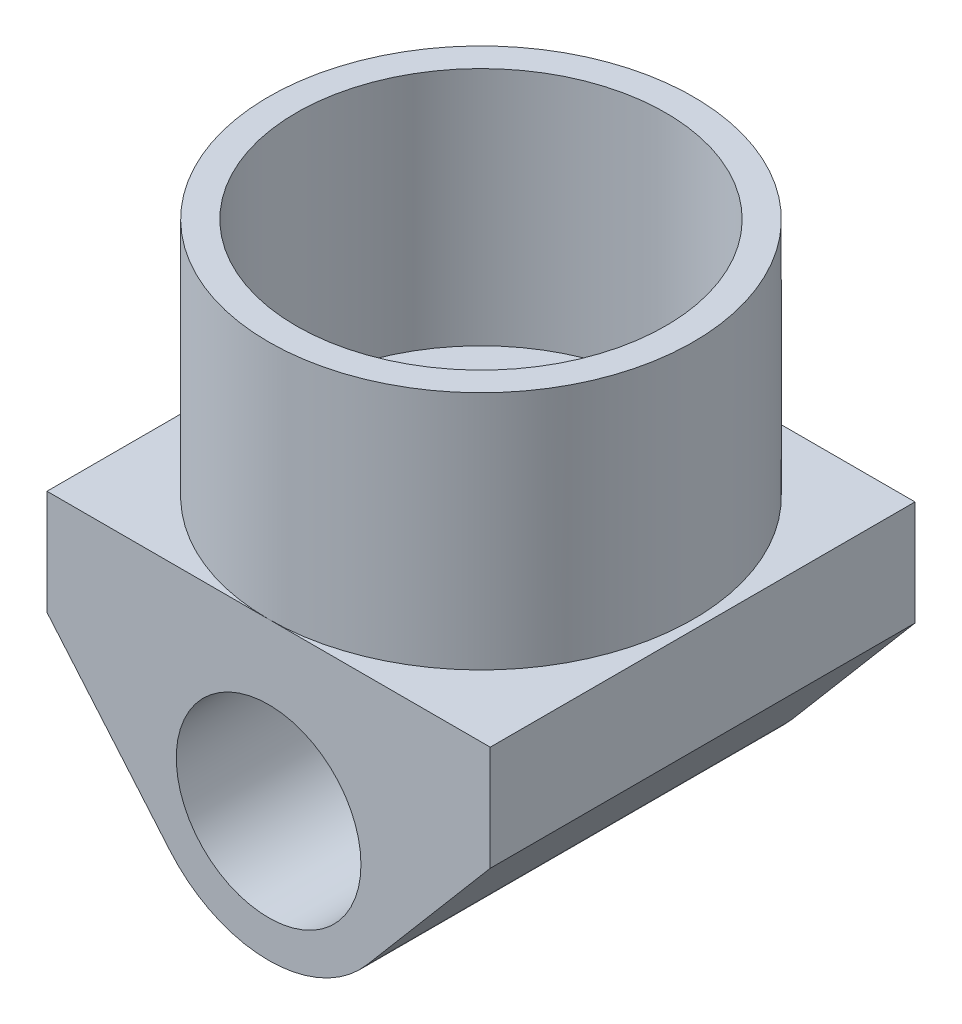
ISO-10303-21;
HEADER;
FILE_DESCRIPTION(('STEP AP214'),'2;1');
FILE_NAME('part.step','',(''),(''),'','','');
FILE_SCHEMA(('AUTOMOTIVE_DESIGN { 1 0 10303 214 1 1 1 1 }'));
ENDSEC;
DATA;
#1=APPLICATION_CONTEXT('core data for automotive mechanical design processes');
#2=APPLICATION_PROTOCOL_DEFINITION('international standard','automotive_design',2000,#1);
#3=PRODUCT_CONTEXT('',#1,'mechanical');
#4=PRODUCT('Part','Part','',(#3));
#5=PRODUCT_RELATED_PRODUCT_CATEGORY('part','',(#4));
#6=PRODUCT_DEFINITION_FORMATION('','',#4);
#7=PRODUCT_DEFINITION_CONTEXT('part definition',#1,'design');
#8=PRODUCT_DEFINITION('design','',#6,#7);
#9=PRODUCT_DEFINITION_SHAPE('','',#8);
#10=(LENGTH_UNIT() NAMED_UNIT(*) SI_UNIT(.MILLI.,.METRE.));
#11=(NAMED_UNIT(*) PLANE_ANGLE_UNIT() SI_UNIT($,.RADIAN.));
#12=(NAMED_UNIT(*) SI_UNIT($,.STERADIAN.) SOLID_ANGLE_UNIT());
#13=UNCERTAINTY_MEASURE_WITH_UNIT(LENGTH_MEASURE(1.E-05),#10,'distance_accuracy_value','');
#14=(GEOMETRIC_REPRESENTATION_CONTEXT(3) GLOBAL_UNCERTAINTY_ASSIGNED_CONTEXT((#13)) GLOBAL_UNIT_ASSIGNED_CONTEXT((#10,
#11,#12)) REPRESENTATION_CONTEXT('',''));
#15=CARTESIAN_POINT('',(0.,0.,0.));
#16=DIRECTION('',(0.,0.,1.));
#17=DIRECTION('',(1.,0.,0.));
#18=AXIS2_PLACEMENT_3D('',#15,#16,#17);
#19=CARTESIAN_POINT('',(-30.48,-40.64,29.21));
#20=DIRECTION('',(1.,0.,0.));
#21=DIRECTION('',(0.,0.,-1.));
#22=AXIS2_PLACEMENT_3D('',#19,#20,#21);
#23=PLANE('',#22);
#24=DIRECTION('',(0.,0.,-1.));
#25=VECTOR('',#24,1.);
#26=CARTESIAN_POINT('',(-30.48,-14.4295302321558,169.270330750716));
#27=LINE('',#26,#25);
#28=CARTESIAN_POINT('',(-30.48,-14.4295302321558,29.21));
#29=VERTEX_POINT('',#28);
#30=CARTESIAN_POINT('',(-30.48,-14.4295302321558,-29.21));
#31=VERTEX_POINT('',#30);
#32=EDGE_CURVE('E106',#29,#31,#27,.T.);
#33=ORIENTED_EDGE('',*,*,#32,.F.);
#34=DIRECTION('',(0.,1.,0.));
#35=VECTOR('',#34,1.);
#36=CARTESIAN_POINT('',(-30.48,-40.64,29.21));
#37=LINE('',#36,#35);
#38=CARTESIAN_POINT('',(-30.48,0.,29.21));
#39=VERTEX_POINT('',#38);
#40=EDGE_CURVE('E91',#29,#39,#37,.T.);
#41=ORIENTED_EDGE('',*,*,#40,.T.);
#42=DIRECTION('',(0.,0.,-1.));
#43=VECTOR('',#42,1.);
#44=CARTESIAN_POINT('',(-30.48,0.,29.21));
#45=LINE('',#44,#43);
#46=CARTESIAN_POINT('',(-30.48,0.,-29.21));
#47=VERTEX_POINT('',#46);
#48=EDGE_CURVE('E134',#39,#47,#45,.T.);
#49=ORIENTED_EDGE('',*,*,#48,.T.);
#50=DIRECTION('',(0.,1.,0.));
#51=VECTOR('',#50,1.);
#52=CARTESIAN_POINT('',(-30.48,-40.64,-29.21));
#53=LINE('',#52,#51);
#54=EDGE_CURVE('E107',#31,#47,#53,.T.);
#55=ORIENTED_EDGE('',*,*,#54,.F.);
#56=EDGE_LOOP('',(#33,#41,#49,#55));
#57=FACE_BOUND('',#56,.T.);
#58=ADVANCED_FACE('F34',(#57),#23,.F.);
#59=CARTESIAN_POINT('',(-30.48,-40.64,-29.21));
#60=DIRECTION('',(0.,0.,1.));
#61=DIRECTION('',(1.,0.,0.));
#62=AXIS2_PLACEMENT_3D('',#59,#60,#61);
#63=PLANE('',#62);
#64=CARTESIAN_POINT('',(0.,-22.86,-29.21));
#65=DIRECTION('',(0.,0.,1.));
#66=DIRECTION('',(1.,0.,0.));
#67=AXIS2_PLACEMENT_3D('',#64,#65,#66);
#68=CIRCLE('',#67,12.7);
#69=CARTESIAN_POINT('',(12.7,-22.86,-29.21));
#70=VERTEX_POINT('',#69);
#71=EDGE_CURVE('E136',#70,#70,#68,.T.);
#72=ORIENTED_EDGE('',*,*,#71,.T.);
#73=EDGE_LOOP('',(#72));
#74=FACE_BOUND('',#73,.T.);
#75=DIRECTION('',(0.647180211425364,0.76233704746616,0.));
#76=VECTOR('',#75,1.);
#77=CARTESIAN_POINT('',(-7.98406719505333,-59.7377502632291,-29.21));
#78=LINE('',#77,#76);
#79=CARTESIAN_POINT('',(13.5543527039483,-34.366864159143,-29.21));
#80=VERTEX_POINT('',#79);
#81=CARTESIAN_POINT('',(30.48,-14.4295302321558,-29.21));
#82=VERTEX_POINT('',#81);
#83=EDGE_CURVE('E146',#80,#82,#78,.T.);
#84=ORIENTED_EDGE('',*,*,#83,.F.);
#85=CARTESIAN_POINT('',(0.,-22.86,-29.21));
#86=DIRECTION('',(0.,0.,1.));
#87=DIRECTION('',(1.,0.,0.));
#88=AXIS2_PLACEMENT_3D('',#85,#86,#87);
#89=CIRCLE('',#88,17.78);
#90=CARTESIAN_POINT('',(-13.5543527039483,-34.366864159143,-29.21));
#91=VERTEX_POINT('',#90);
#92=EDGE_CURVE('E49',#91,#80,#89,.T.);
#93=ORIENTED_EDGE('',*,*,#92,.F.);
#94=DIRECTION('',(0.647180211425364,-0.762337047466159,0.));
#95=VECTOR('',#94,1.);
#96=CARTESIAN_POINT('',(-17.5485549055995,-29.6619484963426,-29.21));
#97=LINE('',#96,#95);
#98=EDGE_CURVE('E151',#31,#91,#97,.T.);
#99=ORIENTED_EDGE('',*,*,#98,.F.);
#100=ORIENTED_EDGE('',*,*,#54,.T.);
#101=DIRECTION('',(1.,0.,0.));
#102=VECTOR('',#101,1.);
#103=CARTESIAN_POINT('',(-30.48,0.,-29.21));
#104=LINE('',#103,#102);
#105=CARTESIAN_POINT('',(0.,0.,-29.21));
#106=VERTEX_POINT('',#105);
#107=EDGE_CURVE('E130',#47,#106,#104,.T.);
#108=ORIENTED_EDGE('',*,*,#107,.T.);
#109=CARTESIAN_POINT('',(30.48,0.,-29.21));
#110=VERTEX_POINT('',#109);
#111=EDGE_CURVE('E133',#106,#110,#104,.T.);
#112=ORIENTED_EDGE('',*,*,#111,.T.);
#113=DIRECTION('',(0.,1.,0.));
#114=VECTOR('',#113,1.);
#115=CARTESIAN_POINT('',(30.48,-40.64,-29.21));
#116=LINE('',#115,#114);
#117=EDGE_CURVE('E123',#82,#110,#116,.T.);
#118=ORIENTED_EDGE('',*,*,#117,.F.);
#119=EDGE_LOOP('',(#84,#93,#99,#100,#108,#112,#118));
#120=FACE_BOUND('',#119,.T.);
#121=ADVANCED_FACE('F169',(#74,#120),#63,.F.);
#122=CARTESIAN_POINT('',(30.48,-40.64,29.21));
#123=DIRECTION('',(-1.,0.,0.));
#124=DIRECTION('',(0.,0.,1.));
#125=AXIS2_PLACEMENT_3D('',#122,#123,#124);
#126=PLANE('',#125);
#127=DIRECTION('',(0.,0.,-1.));
#128=VECTOR('',#127,1.);
#129=CARTESIAN_POINT('',(30.48,-14.4295302321558,169.270330750716));
#130=LINE('',#129,#128);
#131=CARTESIAN_POINT('',(30.48,-14.4295302321558,29.21));
#132=VERTEX_POINT('',#131);
#133=EDGE_CURVE('E156',#132,#82,#130,.T.);
#134=ORIENTED_EDGE('',*,*,#133,.T.);
#135=ORIENTED_EDGE('',*,*,#117,.T.);
#136=DIRECTION('',(0.,0.,1.));
#137=VECTOR('',#136,1.);
#138=CARTESIAN_POINT('',(30.48,0.,29.21));
#139=LINE('',#138,#137);
#140=CARTESIAN_POINT('',(30.48,0.,29.21));
#141=VERTEX_POINT('',#140);
#142=EDGE_CURVE('E127',#110,#141,#139,.T.);
#143=ORIENTED_EDGE('',*,*,#142,.T.);
#144=DIRECTION('',(0.,1.,0.));
#145=VECTOR('',#144,1.);
#146=CARTESIAN_POINT('',(30.48,-40.64,29.21));
#147=LINE('',#146,#145);
#148=EDGE_CURVE('E101',#132,#141,#147,.T.);
#149=ORIENTED_EDGE('',*,*,#148,.F.);
#150=EDGE_LOOP('',(#134,#135,#143,#149));
#151=FACE_BOUND('',#150,.T.);
#152=ADVANCED_FACE('F167',(#151),#126,.F.);
#153=CARTESIAN_POINT('',(-30.48,-40.64,29.21));
#154=DIRECTION('',(0.,0.,-1.));
#155=DIRECTION('',(-1.,0.,0.));
#156=AXIS2_PLACEMENT_3D('',#153,#154,#155);
#157=PLANE('',#156);
#158=CARTESIAN_POINT('',(0.,-22.86,29.21));
#159=DIRECTION('',(0.,0.,1.));
#160=DIRECTION('',(1.,0.,0.));
#161=AXIS2_PLACEMENT_3D('',#158,#159,#160);
#162=CIRCLE('',#161,12.7);
#163=CARTESIAN_POINT('',(12.7,-22.86,29.21));
#164=VERTEX_POINT('',#163);
#165=EDGE_CURVE('E137',#164,#164,#162,.T.);
#166=ORIENTED_EDGE('',*,*,#165,.F.);
#167=EDGE_LOOP('',(#166));
#168=FACE_BOUND('',#167,.T.);
#169=DIRECTION('',(-0.647180211425364,-0.76233704746616,0.));
#170=VECTOR('',#169,1.);
#171=CARTESIAN_POINT('',(-7.98406719505333,-59.7377502632291,29.21));
#172=LINE('',#171,#170);
#173=CARTESIAN_POINT('',(13.5543527039483,-34.366864159143,29.21));
#174=VERTEX_POINT('',#173);
#175=EDGE_CURVE('E11',#132,#174,#172,.T.);
#176=ORIENTED_EDGE('',*,*,#175,.F.);
#177=ORIENTED_EDGE('',*,*,#148,.T.);
#178=DIRECTION('',(-1.,0.,0.));
#179=VECTOR('',#178,1.);
#180=CARTESIAN_POINT('',(-30.48,0.,29.21));
#181=LINE('',#180,#179);
#182=CARTESIAN_POINT('',(0.,0.,29.21));
#183=VERTEX_POINT('',#182);
#184=EDGE_CURVE('E102',#141,#183,#181,.T.);
#185=ORIENTED_EDGE('',*,*,#184,.T.);
#186=EDGE_CURVE('E97',#183,#39,#181,.T.);
#187=ORIENTED_EDGE('',*,*,#186,.T.);
#188=ORIENTED_EDGE('',*,*,#40,.F.);
#189=DIRECTION('',(-0.647180211425364,0.762337047466159,0.));
#190=VECTOR('',#189,1.);
#191=CARTESIAN_POINT('',(-17.5485549055995,-29.6619484963426,29.21));
#192=LINE('',#191,#190);
#193=CARTESIAN_POINT('',(-13.5543527039483,-34.366864159143,29.21));
#194=VERTEX_POINT('',#193);
#195=EDGE_CURVE('E42',#194,#29,#192,.T.);
#196=ORIENTED_EDGE('',*,*,#195,.F.);
#197=CARTESIAN_POINT('',(0.,-22.86,29.21));
#198=DIRECTION('',(0.,0.,-1.));
#199=DIRECTION('',(-1.,0.,0.));
#200=AXIS2_PLACEMENT_3D('',#197,#198,#199);
#201=CIRCLE('',#200,17.78);
#202=EDGE_CURVE('E154',#174,#194,#201,.T.);
#203=ORIENTED_EDGE('',*,*,#202,.F.);
#204=EDGE_LOOP('',(#176,#177,#185,#187,#188,#196,#203));
#205=FACE_BOUND('',#204,.T.);
#206=ADVANCED_FACE('F93',(#168,#205),#157,.F.);
#207=CARTESIAN_POINT('',(0.,33.02,0.));
#208=DIRECTION('',(0.,-1.,0.));
#209=DIRECTION('',(0.,0.,-1.));
#210=AXIS2_PLACEMENT_3D('',#207,#208,#209);
#211=CYLINDRICAL_SURFACE('',#210,29.21);
#212=CARTESIAN_POINT('',(0.,33.02,0.));
#213=DIRECTION('',(0.,1.,0.));
#214=DIRECTION('',(0.,0.,1.));
#215=AXIS2_PLACEMENT_3D('',#212,#213,#214);
#216=CIRCLE('',#215,29.21);
#217=CARTESIAN_POINT('',(0.,33.02,29.21));
#218=VERTEX_POINT('',#217);
#219=EDGE_CURVE('E114',#218,#218,#216,.T.);
#220=ORIENTED_EDGE('',*,*,#219,.F.);
#221=EDGE_LOOP('',(#220));
#222=FACE_BOUND('',#221,.T.);
#223=CARTESIAN_POINT('',(0.,0.,0.));
#224=DIRECTION('',(0.,1.,0.));
#225=DIRECTION('',(0.,0.,1.));
#226=AXIS2_PLACEMENT_3D('',#223,#224,#225);
#227=CIRCLE('',#226,29.21);
#228=EDGE_CURVE('E116',#183,#106,#227,.T.);
#229=ORIENTED_EDGE('',*,*,#228,.T.);
#230=EDGE_CURVE('E120',#106,#183,#227,.T.);
#231=ORIENTED_EDGE('',*,*,#230,.T.);
#232=EDGE_LOOP('',(#229,#231));
#233=FACE_BOUND('',#232,.T.);
#234=ADVANCED_FACE('F36',(#222,#233),#211,.T.);
#235=CARTESIAN_POINT('',(0.,33.02,0.));
#236=DIRECTION('',(0.,1.,0.));
#237=DIRECTION('',(0.,0.,1.));
#238=AXIS2_PLACEMENT_3D('',#235,#236,#237);
#239=PLANE('',#238);
#240=CARTESIAN_POINT('',(0.,33.02,0.));
#241=DIRECTION('',(0.,1.,0.));
#242=DIRECTION('',(0.,0.,1.));
#243=AXIS2_PLACEMENT_3D('',#240,#241,#242);
#244=CIRCLE('',#243,25.4);
#245=CARTESIAN_POINT('',(0.,33.02,25.4));
#246=VERTEX_POINT('',#245);
#247=EDGE_CURVE('E143',#246,#246,#244,.T.);
#248=ORIENTED_EDGE('',*,*,#247,.F.);
#249=EDGE_LOOP('',(#248));
#250=FACE_BOUND('',#249,.T.);
#251=ORIENTED_EDGE('',*,*,#219,.T.);
#252=EDGE_LOOP('',(#251));
#253=FACE_BOUND('',#252,.T.);
#254=ADVANCED_FACE('F182',(#250,#253),#239,.T.);
#255=CARTESIAN_POINT('',(0.,0.,0.));
#256=DIRECTION('',(0.,-1.,0.));
#257=DIRECTION('',(0.,0.,-1.));
#258=AXIS2_PLACEMENT_3D('',#255,#256,#257);
#259=PLANE('',#258);
#260=ORIENTED_EDGE('',*,*,#228,.F.);
#261=ORIENTED_EDGE('',*,*,#184,.F.);
#262=ORIENTED_EDGE('',*,*,#142,.F.);
#263=ORIENTED_EDGE('',*,*,#111,.F.);
#264=EDGE_LOOP('',(#260,#261,#262,#263));
#265=FACE_BOUND('',#264,.T.);
#266=ADVANCED_FACE('F176',(#265),#259,.F.);
#267=ORIENTED_EDGE('',*,*,#230,.F.);
#268=ORIENTED_EDGE('',*,*,#107,.F.);
#269=ORIENTED_EDGE('',*,*,#48,.F.);
#270=ORIENTED_EDGE('',*,*,#186,.F.);
#271=EDGE_LOOP('',(#267,#268,#269,#270));
#272=FACE_BOUND('',#271,.T.);
#273=ADVANCED_FACE('F179',(#272),#259,.F.);
#274=CARTESIAN_POINT('',(0.,-22.86,-29.21));
#275=DIRECTION('',(0.,0.,1.));
#276=DIRECTION('',(1.,0.,0.));
#277=AXIS2_PLACEMENT_3D('',#274,#275,#276);
#278=CYLINDRICAL_SURFACE('',#277,12.7);
#279=ORIENTED_EDGE('',*,*,#71,.F.);
#280=EDGE_LOOP('',(#279));
#281=FACE_BOUND('',#280,.T.);
#282=ORIENTED_EDGE('',*,*,#165,.T.);
#283=EDGE_LOOP('',(#282));
#284=FACE_BOUND('',#283,.T.);
#285=ADVANCED_FACE('F204',(#281,#284),#278,.F.);
#286=CARTESIAN_POINT('',(0.,0.,0.));
#287=DIRECTION('',(0.,1.,0.));
#288=DIRECTION('',(0.,0.,1.));
#289=AXIS2_PLACEMENT_3D('',#286,#287,#288);
#290=CYLINDRICAL_SURFACE('',#289,25.4);
#291=CARTESIAN_POINT('',(0.,0.,0.));
#292=DIRECTION('',(0.,1.,0.));
#293=DIRECTION('',(0.,0.,1.));
#294=AXIS2_PLACEMENT_3D('',#291,#292,#293);
#295=CIRCLE('',#294,25.4);
#296=CARTESIAN_POINT('',(0.,0.,25.4));
#297=VERTEX_POINT('',#296);
#298=EDGE_CURVE('E140',#297,#297,#295,.T.);
#299=ORIENTED_EDGE('',*,*,#298,.F.);
#300=EDGE_LOOP('',(#299));
#301=FACE_BOUND('',#300,.T.);
#302=ORIENTED_EDGE('',*,*,#247,.T.);
#303=EDGE_LOOP('',(#302));
#304=FACE_BOUND('',#303,.T.);
#305=ADVANCED_FACE('F207',(#301,#304),#290,.F.);
#306=CARTESIAN_POINT('',(0.,0.,0.));
#307=DIRECTION('',(0.,1.,0.));
#308=DIRECTION('',(0.,0.,1.));
#309=AXIS2_PLACEMENT_3D('',#306,#307,#308);
#310=PLANE('',#309);
#311=ORIENTED_EDGE('',*,*,#298,.T.);
#312=EDGE_LOOP('',(#311));
#313=FACE_BOUND('',#312,.T.);
#314=ADVANCED_FACE('F211',(#313),#310,.T.);
#315=CARTESIAN_POINT('',(13.5543527039483,-34.366864159143,169.270330750716));
#316=DIRECTION('',(0.762337047466159,-0.647180211425364,0.));
#317=DIRECTION('',(0.647180211425364,0.76233704746616,0.));
#318=AXIS2_PLACEMENT_3D('',#315,#316,#317);
#319=PLANE('',#318);
#320=DIRECTION('',(0.,0.,-1.));
#321=VECTOR('',#320,1.);
#322=CARTESIAN_POINT('',(13.5543527039483,-34.366864159143,169.270330750716));
#323=LINE('',#322,#321);
#324=EDGE_CURVE('E109',#174,#80,#323,.T.);
#325=ORIENTED_EDGE('',*,*,#324,.T.);
#326=ORIENTED_EDGE('',*,*,#83,.T.);
#327=ORIENTED_EDGE('',*,*,#133,.F.);
#328=ORIENTED_EDGE('',*,*,#175,.T.);
#329=EDGE_LOOP('',(#325,#326,#327,#328));
#330=FACE_BOUND('',#329,.T.);
#331=ADVANCED_FACE('F164',(#330),#319,.T.);
#332=CARTESIAN_POINT('',(-13.5543527039483,-34.366864159143,169.270330750716));
#333=DIRECTION('',(-0.762337047466159,-0.647180211425364,0.));
#334=DIRECTION('',(0.647180211425364,-0.762337047466159,0.));
#335=AXIS2_PLACEMENT_3D('',#332,#333,#334);
#336=PLANE('',#335);
#337=ORIENTED_EDGE('',*,*,#32,.T.);
#338=ORIENTED_EDGE('',*,*,#98,.T.);
#339=DIRECTION('',(0.,0.,-1.));
#340=VECTOR('',#339,1.);
#341=CARTESIAN_POINT('',(-13.5543527039483,-34.366864159143,169.270330750716));
#342=LINE('',#341,#340);
#343=EDGE_CURVE('E110',#194,#91,#342,.T.);
#344=ORIENTED_EDGE('',*,*,#343,.F.);
#345=ORIENTED_EDGE('',*,*,#195,.T.);
#346=EDGE_LOOP('',(#337,#338,#344,#345));
#347=FACE_BOUND('',#346,.T.);
#348=ADVANCED_FACE('F113',(#347),#336,.T.);
#349=CARTESIAN_POINT('',(0.,-22.86,169.270330750716));
#350=DIRECTION('',(0.,0.,-1.));
#351=DIRECTION('',(-1.,0.,0.));
#352=AXIS2_PLACEMENT_3D('',#349,#350,#351);
#353=CYLINDRICAL_SURFACE('',#352,17.78);
#354=ORIENTED_EDGE('',*,*,#343,.T.);
#355=ORIENTED_EDGE('',*,*,#92,.T.);
#356=ORIENTED_EDGE('',*,*,#324,.F.);
#357=ORIENTED_EDGE('',*,*,#202,.T.);
#358=EDGE_LOOP('',(#354,#355,#356,#357));
#359=FACE_BOUND('',#358,.T.);
#360=ADVANCED_FACE('F160',(#359),#353,.T.);
#361=CLOSED_SHELL('',(#58,#121,#152,#206,#234,#254,#266,#273,#285,#305,#314,#331,#348,#360));
#362=MANIFOLD_SOLID_BREP('B2',#361);
#363=ADVANCED_BREP_SHAPE_REPRESENTATION('',(#18,#362),#14);
#364=SHAPE_DEFINITION_REPRESENTATION(#9,#363);
ENDSEC;
END-ISO-10303-21;
